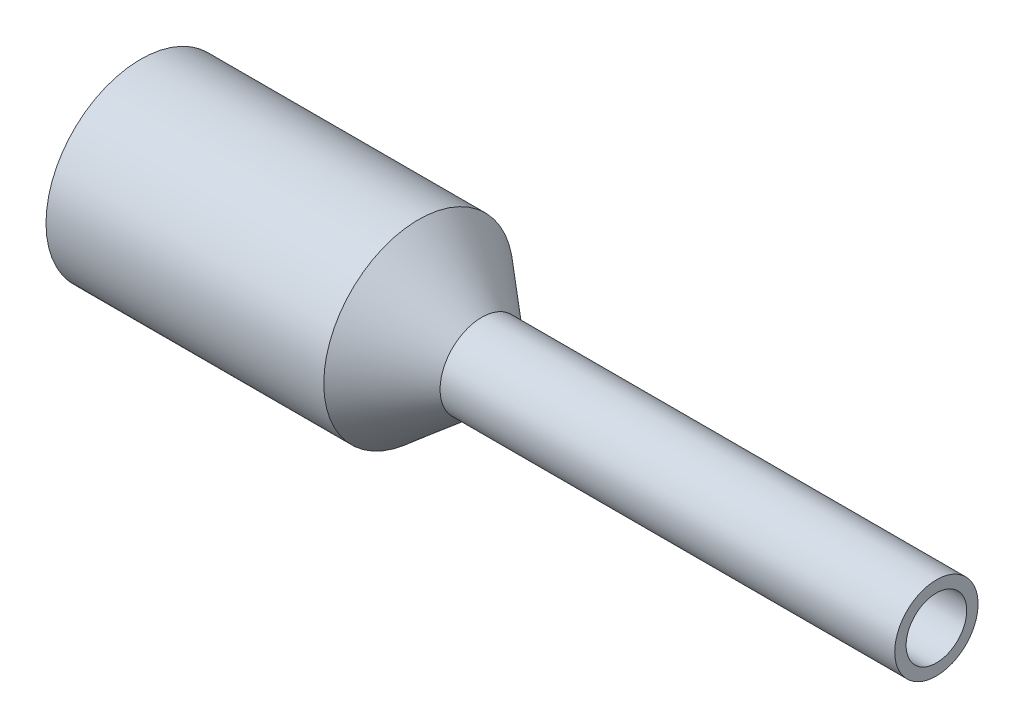
ISO-10303-21;
HEADER;
FILE_DESCRIPTION(('STEP AP214'),'2;1');
FILE_NAME('part.step','',(''),(''),'','','');
FILE_SCHEMA(('AUTOMOTIVE_DESIGN { 1 0 10303 214 1 1 1 1 }'));
ENDSEC;
DATA;
#1=APPLICATION_CONTEXT('core data for automotive mechanical design processes');
#2=APPLICATION_PROTOCOL_DEFINITION('international standard','automotive_design',2000,#1);
#3=PRODUCT_CONTEXT('',#1,'mechanical');
#4=PRODUCT('Part','Part','',(#3));
#5=PRODUCT_RELATED_PRODUCT_CATEGORY('part','',(#4));
#6=PRODUCT_DEFINITION_FORMATION('','',#4);
#7=PRODUCT_DEFINITION_CONTEXT('part definition',#1,'design');
#8=PRODUCT_DEFINITION('design','',#6,#7);
#9=PRODUCT_DEFINITION_SHAPE('','',#8);
#10=(LENGTH_UNIT() NAMED_UNIT(*) SI_UNIT(.MILLI.,.METRE.));
#11=(NAMED_UNIT(*) PLANE_ANGLE_UNIT() SI_UNIT($,.RADIAN.));
#12=(NAMED_UNIT(*) SI_UNIT($,.STERADIAN.) SOLID_ANGLE_UNIT());
#13=UNCERTAINTY_MEASURE_WITH_UNIT(LENGTH_MEASURE(1.E-05),#10,'distance_accuracy_value','');
#14=(GEOMETRIC_REPRESENTATION_CONTEXT(3) GLOBAL_UNCERTAINTY_ASSIGNED_CONTEXT((#13)) GLOBAL_UNIT_ASSIGNED_CONTEXT((#10,
#11,#12)) REPRESENTATION_CONTEXT('',''));
#15=CARTESIAN_POINT('',(0.,0.,0.));
#16=DIRECTION('',(0.,0.,1.));
#17=DIRECTION('',(1.,0.,0.));
#18=AXIS2_PLACEMENT_3D('',#15,#16,#17);
#19=CARTESIAN_POINT('',(5.25,0.399999999999996,0.));
#20=DIRECTION('',(-1.,0.,0.));
#21=DIRECTION('',(0.,0.,1.));
#22=AXIS2_PLACEMENT_3D('',#19,#20,#21);
#23=PLANE('',#22);
#24=CARTESIAN_POINT('',(5.25,0.,0.));
#25=DIRECTION('',(-1.,0.,0.));
#26=DIRECTION('',(0.,0.,1.));
#27=AXIS2_PLACEMENT_3D('',#24,#25,#26);
#28=CIRCLE('',#27,0.549999999999995);
#29=CARTESIAN_POINT('',(5.25,0.,0.549999999999995));
#30=VERTEX_POINT('',#29);
#31=EDGE_CURVE('E10',#30,#30,#28,.T.);
#32=ORIENTED_EDGE('',*,*,#31,.F.);
#33=EDGE_LOOP('',(#32));
#34=FACE_BOUND('',#33,.T.);
#35=CARTESIAN_POINT('',(5.25,0.,0.));
#36=DIRECTION('',(-1.,0.,0.));
#37=DIRECTION('',(0.,0.,1.));
#38=AXIS2_PLACEMENT_3D('',#35,#36,#37);
#39=CIRCLE('',#38,0.399999999999996);
#40=CARTESIAN_POINT('',(5.25,0.,0.399999999999996));
#41=VERTEX_POINT('',#40);
#42=EDGE_CURVE('E60',#41,#41,#39,.T.);
#43=ORIENTED_EDGE('',*,*,#42,.T.);
#44=EDGE_LOOP('',(#43));
#45=FACE_BOUND('',#44,.T.);
#46=ADVANCED_FACE('F32',(#34,#45),#23,.F.);
#47=CARTESIAN_POINT('',(-5.25,0.,0.));
#48=DIRECTION('',(-1.,0.,0.));
#49=DIRECTION('',(0.,0.,1.));
#50=AXIS2_PLACEMENT_3D('',#47,#48,#49);
#51=CYLINDRICAL_SURFACE('',#50,0.549999999999995);
#52=CARTESIAN_POINT('',(-0.749999999999999,0.,0.));
#53=DIRECTION('',(-1.,0.,0.));
#54=DIRECTION('',(0.,0.,1.));
#55=AXIS2_PLACEMENT_3D('',#52,#53,#54);
#56=CIRCLE('',#55,0.549999999999995);
#57=CARTESIAN_POINT('',(-0.749999999999999,0.,0.549999999999995));
#58=VERTEX_POINT('',#57);
#59=EDGE_CURVE('E38',#58,#58,#56,.T.);
#60=ORIENTED_EDGE('',*,*,#59,.F.);
#61=EDGE_LOOP('',(#60));
#62=FACE_BOUND('',#61,.T.);
#63=ORIENTED_EDGE('',*,*,#31,.T.);
#64=EDGE_LOOP('',(#63));
#65=FACE_BOUND('',#64,.T.);
#66=ADVANCED_FACE('F97',(#62,#65),#51,.T.);
#67=CARTESIAN_POINT('',(-0.749999999999999,0.,0.));
#68=DIRECTION('',(-1.,0.,0.));
#69=DIRECTION('',(0.,0.,1.));
#70=AXIS2_PLACEMENT_3D('',#67,#68,#69);
#71=CONICAL_SURFACE('',#70,0.549999999999995,0.698131700797726);
#72=CARTESIAN_POINT('',(-1.58422751481596,0.,0.));
#73=DIRECTION('',(-1.,0.,0.));
#74=DIRECTION('',(0.,0.,1.));
#75=AXIS2_PLACEMENT_3D('',#72,#73,#74);
#76=CIRCLE('',#75,1.25);
#77=CARTESIAN_POINT('',(-1.58422751481596,0.,1.25));
#78=VERTEX_POINT('',#77);
#79=EDGE_CURVE('E42',#78,#78,#76,.T.);
#80=ORIENTED_EDGE('',*,*,#79,.F.);
#81=EDGE_LOOP('',(#80));
#82=FACE_BOUND('',#81,.T.);
#83=ORIENTED_EDGE('',*,*,#59,.T.);
#84=EDGE_LOOP('',(#83));
#85=FACE_BOUND('',#84,.T.);
#86=ADVANCED_FACE('F92',(#82,#85),#71,.T.);
#87=CARTESIAN_POINT('',(-5.25,0.,0.));
#88=DIRECTION('',(-1.,0.,0.));
#89=DIRECTION('',(0.,0.,1.));
#90=AXIS2_PLACEMENT_3D('',#87,#88,#89);
#91=CYLINDRICAL_SURFACE('',#90,1.25);
#92=CARTESIAN_POINT('',(-5.25,0.,0.));
#93=DIRECTION('',(-1.,0.,0.));
#94=DIRECTION('',(0.,0.,1.));
#95=AXIS2_PLACEMENT_3D('',#92,#93,#94);
#96=CIRCLE('',#95,1.25);
#97=CARTESIAN_POINT('',(-5.25,0.,1.25));
#98=VERTEX_POINT('',#97);
#99=EDGE_CURVE('E46',#98,#98,#96,.T.);
#100=ORIENTED_EDGE('',*,*,#99,.F.);
#101=EDGE_LOOP('',(#100));
#102=FACE_BOUND('',#101,.T.);
#103=ORIENTED_EDGE('',*,*,#79,.T.);
#104=EDGE_LOOP('',(#103));
#105=FACE_BOUND('',#104,.T.);
#106=ADVANCED_FACE('F86',(#102,#105),#91,.T.);
#107=CARTESIAN_POINT('',(-5.25,1.,0.));
#108=DIRECTION('',(1.,0.,0.));
#109=DIRECTION('',(0.,0.,-1.));
#110=AXIS2_PLACEMENT_3D('',#107,#108,#109);
#111=PLANE('',#110);
#112=CARTESIAN_POINT('',(-5.25,0.,0.));
#113=DIRECTION('',(-1.,0.,0.));
#114=DIRECTION('',(0.,0.,1.));
#115=AXIS2_PLACEMENT_3D('',#112,#113,#114);
#116=CIRCLE('',#115,1.);
#117=CARTESIAN_POINT('',(-5.25,0.,1.));
#118=VERTEX_POINT('',#117);
#119=EDGE_CURVE('E51',#118,#118,#116,.T.);
#120=ORIENTED_EDGE('',*,*,#119,.F.);
#121=EDGE_LOOP('',(#120));
#122=FACE_BOUND('',#121,.T.);
#123=ORIENTED_EDGE('',*,*,#99,.T.);
#124=EDGE_LOOP('',(#123));
#125=FACE_BOUND('',#124,.T.);
#126=ADVANCED_FACE('F80',(#122,#125),#111,.F.);
#127=CARTESIAN_POINT('',(-5.25,0.,0.));
#128=DIRECTION('',(-1.,0.,0.));
#129=DIRECTION('',(0.,0.,1.));
#130=AXIS2_PLACEMENT_3D('',#127,#128,#129);
#131=CYLINDRICAL_SURFACE('',#130,1.);
#132=CARTESIAN_POINT('',(-1.58422751481596,0.,0.));
#133=DIRECTION('',(-1.,0.,0.));
#134=DIRECTION('',(0.,0.,1.));
#135=AXIS2_PLACEMENT_3D('',#132,#133,#134);
#136=CIRCLE('',#135,1.);
#137=CARTESIAN_POINT('',(-1.58422751481596,0.,1.));
#138=VERTEX_POINT('',#137);
#139=EDGE_CURVE('E54',#138,#138,#136,.T.);
#140=ORIENTED_EDGE('',*,*,#139,.F.);
#141=EDGE_LOOP('',(#140));
#142=FACE_BOUND('',#141,.T.);
#143=ORIENTED_EDGE('',*,*,#119,.T.);
#144=EDGE_LOOP('',(#143));
#145=FACE_BOUND('',#144,.T.);
#146=ADVANCED_FACE('F74',(#142,#145),#131,.F.);
#147=CARTESIAN_POINT('',(-1.58422751481596,0.,0.));
#148=DIRECTION('',(-1.,0.,0.));
#149=DIRECTION('',(0.,0.,1.));
#150=AXIS2_PLACEMENT_3D('',#147,#148,#149);
#151=CONICAL_SURFACE('',#150,1.,0.623514605162698);
#152=CARTESIAN_POINT('',(-0.749999999999999,0.,0.));
#153=DIRECTION('',(-1.,0.,0.));
#154=DIRECTION('',(0.,0.,1.));
#155=AXIS2_PLACEMENT_3D('',#152,#153,#154);
#156=CIRCLE('',#155,0.399999999999996);
#157=CARTESIAN_POINT('',(-0.749999999999999,0.,0.399999999999996));
#158=VERTEX_POINT('',#157);
#159=EDGE_CURVE('E57',#158,#158,#156,.T.);
#160=ORIENTED_EDGE('',*,*,#159,.F.);
#161=EDGE_LOOP('',(#160));
#162=FACE_BOUND('',#161,.T.);
#163=ORIENTED_EDGE('',*,*,#139,.T.);
#164=EDGE_LOOP('',(#163));
#165=FACE_BOUND('',#164,.T.);
#166=ADVANCED_FACE('F68',(#162,#165),#151,.F.);
#167=CARTESIAN_POINT('',(-5.25,0.,0.));
#168=DIRECTION('',(-1.,0.,0.));
#169=DIRECTION('',(0.,0.,1.));
#170=AXIS2_PLACEMENT_3D('',#167,#168,#169);
#171=CYLINDRICAL_SURFACE('',#170,0.399999999999996);
#172=ORIENTED_EDGE('',*,*,#42,.F.);
#173=EDGE_LOOP('',(#172));
#174=FACE_BOUND('',#173,.T.);
#175=ORIENTED_EDGE('',*,*,#159,.T.);
#176=EDGE_LOOP('',(#175));
#177=FACE_BOUND('',#176,.T.);
#178=ADVANCED_FACE('F65',(#174,#177),#171,.F.);
#179=CLOSED_SHELL('',(#46,#66,#86,#106,#126,#146,#166,#178));
#180=MANIFOLD_SOLID_BREP('B2',#179);
#181=ADVANCED_BREP_SHAPE_REPRESENTATION('',(#18,#180),#14);
#182=SHAPE_DEFINITION_REPRESENTATION(#9,#181);
ENDSEC;
END-ISO-10303-21;
